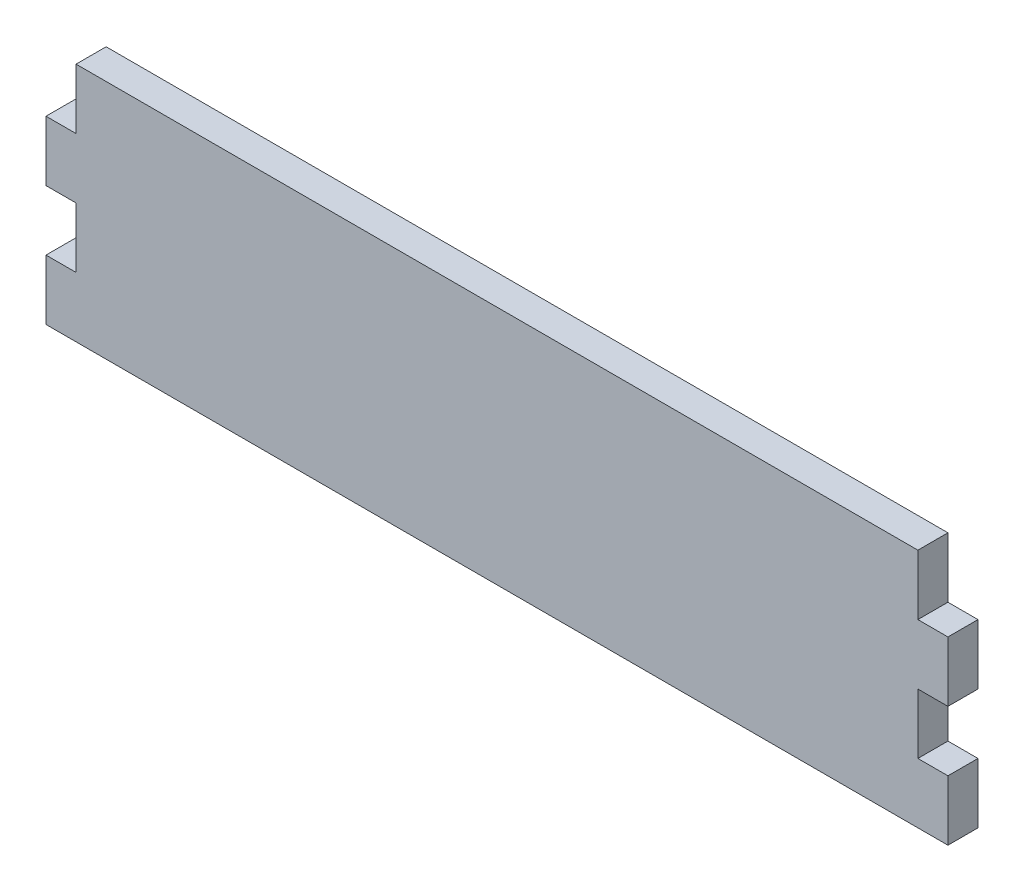
ISO-10303-21;
HEADER;
FILE_DESCRIPTION(('STEP AP214'),'2;1');
FILE_NAME('part.step','',(''),(''),'','','');
FILE_SCHEMA(('AUTOMOTIVE_DESIGN { 1 0 10303 214 1 1 1 1 }'));
ENDSEC;
DATA;
#1=APPLICATION_CONTEXT('core data for automotive mechanical design processes');
#2=APPLICATION_PROTOCOL_DEFINITION('international standard','automotive_design',2000,#1);
#3=PRODUCT_CONTEXT('',#1,'mechanical');
#4=PRODUCT('Part','Part','',(#3));
#5=PRODUCT_RELATED_PRODUCT_CATEGORY('part','',(#4));
#6=PRODUCT_DEFINITION_FORMATION('','',#4);
#7=PRODUCT_DEFINITION_CONTEXT('part definition',#1,'design');
#8=PRODUCT_DEFINITION('design','',#6,#7);
#9=PRODUCT_DEFINITION_SHAPE('','',#8);
#10=(LENGTH_UNIT() NAMED_UNIT(*) SI_UNIT(.MILLI.,.METRE.));
#11=(NAMED_UNIT(*) PLANE_ANGLE_UNIT() SI_UNIT($,.RADIAN.));
#12=(NAMED_UNIT(*) SI_UNIT($,.STERADIAN.) SOLID_ANGLE_UNIT());
#13=UNCERTAINTY_MEASURE_WITH_UNIT(LENGTH_MEASURE(1.E-05),#10,'distance_accuracy_value','');
#14=(GEOMETRIC_REPRESENTATION_CONTEXT(3) GLOBAL_UNCERTAINTY_ASSIGNED_CONTEXT((#13)) GLOBAL_UNIT_ASSIGNED_CONTEXT((#10,
#11,#12)) REPRESENTATION_CONTEXT('',''));
#15=CARTESIAN_POINT('',(0.,0.,0.));
#16=DIRECTION('',(0.,0.,1.));
#17=DIRECTION('',(1.,0.,0.));
#18=AXIS2_PLACEMENT_3D('',#15,#16,#17);
#19=CARTESIAN_POINT('',(-95.25,25.4,6.35));
#20=DIRECTION('',(1.,0.,0.));
#21=DIRECTION('',(0.,0.,-1.));
#22=AXIS2_PLACEMENT_3D('',#19,#20,#21);
#23=PLANE('',#22);
#24=DIRECTION('',(0.,0.,1.));
#25=VECTOR('',#24,1.);
#26=CARTESIAN_POINT('',(-95.25,12.7,0.));
#27=LINE('',#26,#25);
#28=CARTESIAN_POINT('',(-95.25,12.7,0.));
#29=VERTEX_POINT('',#28);
#30=CARTESIAN_POINT('',(-95.25,12.7,6.35));
#31=VERTEX_POINT('',#30);
#32=EDGE_CURVE('E150',#29,#31,#27,.T.);
#33=ORIENTED_EDGE('',*,*,#32,.F.);
#34=DIRECTION('',(0.,-1.,0.));
#35=VECTOR('',#34,1.);
#36=CARTESIAN_POINT('',(-95.25,25.4,0.));
#37=LINE('',#36,#35);
#38=CARTESIAN_POINT('',(-95.25,0.,0.));
#39=VERTEX_POINT('',#38);
#40=EDGE_CURVE('E161',#29,#39,#37,.T.);
#41=ORIENTED_EDGE('',*,*,#40,.T.);
#42=DIRECTION('',(0.,0.,1.));
#43=VECTOR('',#42,1.);
#44=CARTESIAN_POINT('',(-95.25,0.,0.));
#45=LINE('',#44,#43);
#46=CARTESIAN_POINT('',(-95.25,0.,6.35));
#47=VERTEX_POINT('',#46);
#48=EDGE_CURVE('E264',#39,#47,#45,.T.);
#49=ORIENTED_EDGE('',*,*,#48,.T.);
#50=DIRECTION('',(0.,-1.,0.));
#51=VECTOR('',#50,1.);
#52=CARTESIAN_POINT('',(-95.25,25.4,6.35));
#53=LINE('',#52,#51);
#54=EDGE_CURVE('E163',#31,#47,#53,.T.);
#55=ORIENTED_EDGE('',*,*,#54,.F.);
#56=EDGE_LOOP('',(#33,#41,#49,#55));
#57=FACE_BOUND('',#56,.T.);
#58=ADVANCED_FACE('F33',(#57),#23,.F.);
#59=CARTESIAN_POINT('',(0.,0.,6.35));
#60=DIRECTION('',(0.,0.,1.));
#61=DIRECTION('',(1.,0.,0.));
#62=AXIS2_PLACEMENT_3D('',#59,#60,#61);
#63=PLANE('',#62);
#64=DIRECTION('',(-1.,0.,0.));
#65=VECTOR('',#64,1.);
#66=CARTESIAN_POINT('',(-95.25,25.4,6.35));
#67=LINE('',#66,#65);
#68=CARTESIAN_POINT('',(88.9,25.4,6.35));
#69=VERTEX_POINT('',#68);
#70=CARTESIAN_POINT('',(-88.9,25.4,6.35));
#71=VERTEX_POINT('',#70);
#72=EDGE_CURVE('E214',#69,#71,#67,.T.);
#73=ORIENTED_EDGE('',*,*,#72,.T.);
#74=DIRECTION('',(0.,-1.,0.));
#75=VECTOR('',#74,1.);
#76=CARTESIAN_POINT('',(-88.9,12.7,6.35));
#77=LINE('',#76,#75);
#78=CARTESIAN_POINT('',(-88.9,12.7,6.35));
#79=VERTEX_POINT('',#78);
#80=EDGE_CURVE('E48',#71,#79,#77,.T.);
#81=ORIENTED_EDGE('',*,*,#80,.T.);
#82=DIRECTION('',(-1.,0.,0.));
#83=VECTOR('',#82,1.);
#84=CARTESIAN_POINT('',(-95.25,12.7,6.35));
#85=LINE('',#84,#83);
#86=EDGE_CURVE('E290',#79,#31,#85,.T.);
#87=ORIENTED_EDGE('',*,*,#86,.T.);
#88=ORIENTED_EDGE('',*,*,#54,.T.);
#89=DIRECTION('',(1.,0.,0.));
#90=VECTOR('',#89,1.);
#91=CARTESIAN_POINT('',(-95.25,0.,6.35));
#92=LINE('',#91,#90);
#93=CARTESIAN_POINT('',(-88.9,0.,6.35));
#94=VERTEX_POINT('',#93);
#95=EDGE_CURVE('E275',#47,#94,#92,.T.);
#96=ORIENTED_EDGE('',*,*,#95,.T.);
#97=DIRECTION('',(0.,-1.,0.));
#98=VECTOR('',#97,1.);
#99=CARTESIAN_POINT('',(-88.9,-12.7,6.35));
#100=LINE('',#99,#98);
#101=CARTESIAN_POINT('',(-88.9,-12.7,6.35));
#102=VERTEX_POINT('',#101);
#103=EDGE_CURVE('E279',#94,#102,#100,.T.);
#104=ORIENTED_EDGE('',*,*,#103,.T.);
#105=DIRECTION('',(-1.,0.,0.));
#106=VECTOR('',#105,1.);
#107=CARTESIAN_POINT('',(-95.25,-12.7,6.35));
#108=LINE('',#107,#106);
#109=CARTESIAN_POINT('',(-95.25,-12.7,6.35));
#110=VERTEX_POINT('',#109);
#111=EDGE_CURVE('E223',#102,#110,#108,.T.);
#112=ORIENTED_EDGE('',*,*,#111,.T.);
#113=CARTESIAN_POINT('',(-95.25,-25.4,6.35));
#114=VERTEX_POINT('',#113);
#115=EDGE_CURVE('E188',#110,#114,#53,.T.);
#116=ORIENTED_EDGE('',*,*,#115,.T.);
#117=DIRECTION('',(1.,0.,0.));
#118=VECTOR('',#117,1.);
#119=CARTESIAN_POINT('',(-95.25,-25.4,6.35));
#120=LINE('',#119,#118);
#121=CARTESIAN_POINT('',(95.25,-25.4,6.35));
#122=VERTEX_POINT('',#121);
#123=EDGE_CURVE('E178',#114,#122,#120,.T.);
#124=ORIENTED_EDGE('',*,*,#123,.T.);
#125=DIRECTION('',(0.,1.,0.));
#126=VECTOR('',#125,1.);
#127=CARTESIAN_POINT('',(95.25,25.4,6.35));
#128=LINE('',#127,#126);
#129=CARTESIAN_POINT('',(95.25,-12.7,6.35));
#130=VERTEX_POINT('',#129);
#131=EDGE_CURVE('E213',#122,#130,#128,.T.);
#132=ORIENTED_EDGE('',*,*,#131,.T.);
#133=DIRECTION('',(1.,0.,0.));
#134=VECTOR('',#133,1.);
#135=CARTESIAN_POINT('',(95.25,-12.7,6.35));
#136=LINE('',#135,#134);
#137=CARTESIAN_POINT('',(88.9,-12.7,6.35));
#138=VERTEX_POINT('',#137);
#139=EDGE_CURVE('E206',#138,#130,#136,.T.);
#140=ORIENTED_EDGE('',*,*,#139,.F.);
#141=DIRECTION('',(0.,-1.,0.));
#142=VECTOR('',#141,1.);
#143=CARTESIAN_POINT('',(88.9,-12.7,6.35));
#144=LINE('',#143,#142);
#145=CARTESIAN_POINT('',(88.9,0.,6.35));
#146=VERTEX_POINT('',#145);
#147=EDGE_CURVE('E236',#146,#138,#144,.T.);
#148=ORIENTED_EDGE('',*,*,#147,.F.);
#149=DIRECTION('',(-1.,0.,0.));
#150=VECTOR('',#149,1.);
#151=CARTESIAN_POINT('',(95.25,0.,6.35));
#152=LINE('',#151,#150);
#153=CARTESIAN_POINT('',(95.25,0.,6.35));
#154=VERTEX_POINT('',#153);
#155=EDGE_CURVE('E242',#154,#146,#152,.T.);
#156=ORIENTED_EDGE('',*,*,#155,.F.);
#157=CARTESIAN_POINT('',(95.25,12.7,6.35));
#158=VERTEX_POINT('',#157);
#159=EDGE_CURVE('E172',#154,#158,#128,.T.);
#160=ORIENTED_EDGE('',*,*,#159,.T.);
#161=DIRECTION('',(1.,0.,0.));
#162=VECTOR('',#161,1.);
#163=CARTESIAN_POINT('',(95.25,12.7,6.35));
#164=LINE('',#163,#162);
#165=CARTESIAN_POINT('',(88.9,12.7,6.35));
#166=VERTEX_POINT('',#165);
#167=EDGE_CURVE('E258',#166,#158,#164,.T.);
#168=ORIENTED_EDGE('',*,*,#167,.F.);
#169=DIRECTION('',(0.,-1.,0.));
#170=VECTOR('',#169,1.);
#171=CARTESIAN_POINT('',(88.9,12.7,6.35));
#172=LINE('',#171,#170);
#173=EDGE_CURVE('E261',#69,#166,#172,.T.);
#174=ORIENTED_EDGE('',*,*,#173,.F.);
#175=EDGE_LOOP('',(#73,#81,#87,#88,#96,#104,#112,#116,#124,#132,#140,#148,#156,#160,#168,#174));
#176=FACE_BOUND('',#175,.T.);
#177=ADVANCED_FACE('F221',(#176),#63,.T.);
#178=CARTESIAN_POINT('',(0.,0.,0.));
#179=DIRECTION('',(0.,0.,1.));
#180=DIRECTION('',(1.,0.,0.));
#181=AXIS2_PLACEMENT_3D('',#178,#179,#180);
#182=PLANE('',#181);
#183=DIRECTION('',(0.,-1.,0.));
#184=VECTOR('',#183,1.);
#185=CARTESIAN_POINT('',(-88.9,12.7,0.));
#186=LINE('',#185,#184);
#187=CARTESIAN_POINT('',(-88.9,25.4,0.));
#188=VERTEX_POINT('',#187);
#189=CARTESIAN_POINT('',(-88.9,12.7,0.));
#190=VERTEX_POINT('',#189);
#191=EDGE_CURVE('E156',#188,#190,#186,.T.);
#192=ORIENTED_EDGE('',*,*,#191,.F.);
#193=DIRECTION('',(-1.,0.,0.));
#194=VECTOR('',#193,1.);
#195=CARTESIAN_POINT('',(-95.25,25.4,0.));
#196=LINE('',#195,#194);
#197=CARTESIAN_POINT('',(88.9,25.4,0.));
#198=VERTEX_POINT('',#197);
#199=EDGE_CURVE('E174',#198,#188,#196,.T.);
#200=ORIENTED_EDGE('',*,*,#199,.F.);
#201=DIRECTION('',(0.,-1.,0.));
#202=VECTOR('',#201,1.);
#203=CARTESIAN_POINT('',(88.9,12.7,0.));
#204=LINE('',#203,#202);
#205=CARTESIAN_POINT('',(88.9,12.7,0.));
#206=VERTEX_POINT('',#205);
#207=EDGE_CURVE('E260',#198,#206,#204,.T.);
#208=ORIENTED_EDGE('',*,*,#207,.T.);
#209=DIRECTION('',(1.,0.,0.));
#210=VECTOR('',#209,1.);
#211=CARTESIAN_POINT('',(95.25,12.7,0.));
#212=LINE('',#211,#210);
#213=CARTESIAN_POINT('',(95.25,12.7,0.));
#214=VERTEX_POINT('',#213);
#215=EDGE_CURVE('E255',#206,#214,#212,.T.);
#216=ORIENTED_EDGE('',*,*,#215,.T.);
#217=DIRECTION('',(0.,1.,0.));
#218=VECTOR('',#217,1.);
#219=CARTESIAN_POINT('',(95.25,25.4,0.));
#220=LINE('',#219,#218);
#221=CARTESIAN_POINT('',(95.25,0.,0.));
#222=VERTEX_POINT('',#221);
#223=EDGE_CURVE('E192',#222,#214,#220,.T.);
#224=ORIENTED_EDGE('',*,*,#223,.F.);
#225=DIRECTION('',(-1.,0.,0.));
#226=VECTOR('',#225,1.);
#227=CARTESIAN_POINT('',(95.25,0.,0.));
#228=LINE('',#227,#226);
#229=CARTESIAN_POINT('',(88.9,0.,0.));
#230=VERTEX_POINT('',#229);
#231=EDGE_CURVE('E238',#222,#230,#228,.T.);
#232=ORIENTED_EDGE('',*,*,#231,.T.);
#233=DIRECTION('',(0.,-1.,0.));
#234=VECTOR('',#233,1.);
#235=CARTESIAN_POINT('',(88.9,-12.7,0.));
#236=LINE('',#235,#234);
#237=CARTESIAN_POINT('',(88.9,-12.7,0.));
#238=VERTEX_POINT('',#237);
#239=EDGE_CURVE('E240',#230,#238,#236,.T.);
#240=ORIENTED_EDGE('',*,*,#239,.T.);
#241=DIRECTION('',(1.,0.,0.));
#242=VECTOR('',#241,1.);
#243=CARTESIAN_POINT('',(95.25,-12.7,0.));
#244=LINE('',#243,#242);
#245=CARTESIAN_POINT('',(95.25,-12.7,0.));
#246=VERTEX_POINT('',#245);
#247=EDGE_CURVE('E212',#238,#246,#244,.T.);
#248=ORIENTED_EDGE('',*,*,#247,.T.);
#249=CARTESIAN_POINT('',(95.25,-25.4,0.));
#250=VERTEX_POINT('',#249);
#251=EDGE_CURVE('E191',#250,#246,#220,.T.);
#252=ORIENTED_EDGE('',*,*,#251,.F.);
#253=DIRECTION('',(1.,0.,0.));
#254=VECTOR('',#253,1.);
#255=CARTESIAN_POINT('',(-95.25,-25.4,0.));
#256=LINE('',#255,#254);
#257=CARTESIAN_POINT('',(-95.25,-25.4,0.));
#258=VERTEX_POINT('',#257);
#259=EDGE_CURVE('E169',#258,#250,#256,.T.);
#260=ORIENTED_EDGE('',*,*,#259,.F.);
#261=CARTESIAN_POINT('',(-95.25,-12.7,0.));
#262=VERTEX_POINT('',#261);
#263=EDGE_CURVE('E170',#262,#258,#37,.T.);
#264=ORIENTED_EDGE('',*,*,#263,.F.);
#265=DIRECTION('',(-1.,0.,0.));
#266=VECTOR('',#265,1.);
#267=CARTESIAN_POINT('',(-95.25,-12.7,0.));
#268=LINE('',#267,#266);
#269=CARTESIAN_POINT('',(-88.9,-12.7,0.));
#270=VERTEX_POINT('',#269);
#271=EDGE_CURVE('E278',#270,#262,#268,.T.);
#272=ORIENTED_EDGE('',*,*,#271,.F.);
#273=DIRECTION('',(0.,-1.,0.));
#274=VECTOR('',#273,1.);
#275=CARTESIAN_POINT('',(-88.9,-12.7,0.));
#276=LINE('',#275,#274);
#277=CARTESIAN_POINT('',(-88.9,0.,0.));
#278=VERTEX_POINT('',#277);
#279=EDGE_CURVE('E284',#278,#270,#276,.T.);
#280=ORIENTED_EDGE('',*,*,#279,.F.);
#281=DIRECTION('',(1.,0.,0.));
#282=VECTOR('',#281,1.);
#283=CARTESIAN_POINT('',(-95.25,0.,0.));
#284=LINE('',#283,#282);
#285=EDGE_CURVE('E168',#39,#278,#284,.T.);
#286=ORIENTED_EDGE('',*,*,#285,.F.);
#287=ORIENTED_EDGE('',*,*,#40,.F.);
#288=DIRECTION('',(-1.,0.,0.));
#289=VECTOR('',#288,1.);
#290=CARTESIAN_POINT('',(-95.25,12.7,0.));
#291=LINE('',#290,#289);
#292=EDGE_CURVE('E146',#190,#29,#291,.T.);
#293=ORIENTED_EDGE('',*,*,#292,.F.);
#294=EDGE_LOOP('',(#192,#200,#208,#216,#224,#232,#240,#248,#252,#260,#264,#272,#280,#286,#287,#293));
#295=FACE_BOUND('',#294,.T.);
#296=ADVANCED_FACE('F166',(#295),#182,.F.);
#297=CARTESIAN_POINT('',(-95.25,25.4,6.35));
#298=DIRECTION('',(0.,-1.,0.));
#299=DIRECTION('',(0.,0.,-1.));
#300=AXIS2_PLACEMENT_3D('',#297,#298,#299);
#301=PLANE('',#300);
#302=DIRECTION('',(0.,0.,1.));
#303=VECTOR('',#302,1.);
#304=CARTESIAN_POINT('',(-88.9,25.4,0.));
#305=LINE('',#304,#303);
#306=EDGE_CURVE('E282',#188,#71,#305,.T.);
#307=ORIENTED_EDGE('',*,*,#306,.T.);
#308=ORIENTED_EDGE('',*,*,#72,.F.);
#309=DIRECTION('',(0.,0.,1.));
#310=VECTOR('',#309,1.);
#311=CARTESIAN_POINT('',(88.9,25.4,0.));
#312=LINE('',#311,#310);
#313=EDGE_CURVE('E252',#198,#69,#312,.T.);
#314=ORIENTED_EDGE('',*,*,#313,.F.);
#315=ORIENTED_EDGE('',*,*,#199,.T.);
#316=EDGE_LOOP('',(#307,#308,#314,#315));
#317=FACE_BOUND('',#316,.T.);
#318=ADVANCED_FACE('F296',(#317),#301,.F.);
#319=DIRECTION('',(0.,0.,1.));
#320=VECTOR('',#319,1.);
#321=CARTESIAN_POINT('',(-95.25,-12.7,0.));
#322=LINE('',#321,#320);
#323=EDGE_CURVE('E269',#262,#110,#322,.T.);
#324=ORIENTED_EDGE('',*,*,#323,.F.);
#325=ORIENTED_EDGE('',*,*,#263,.T.);
#326=DIRECTION('',(0.,0.,-1.));
#327=VECTOR('',#326,1.);
#328=CARTESIAN_POINT('',(-95.25,-25.4,6.35));
#329=LINE('',#328,#327);
#330=EDGE_CURVE('E11',#114,#258,#329,.T.);
#331=ORIENTED_EDGE('',*,*,#330,.F.);
#332=ORIENTED_EDGE('',*,*,#115,.F.);
#333=EDGE_LOOP('',(#324,#325,#331,#332));
#334=FACE_BOUND('',#333,.T.);
#335=ADVANCED_FACE('F226',(#334),#23,.F.);
#336=CARTESIAN_POINT('',(95.25,25.4,6.35));
#337=DIRECTION('',(-1.,0.,0.));
#338=DIRECTION('',(0.,0.,1.));
#339=AXIS2_PLACEMENT_3D('',#336,#337,#338);
#340=PLANE('',#339);
#341=ORIENTED_EDGE('',*,*,#251,.T.);
#342=DIRECTION('',(0.,0.,1.));
#343=VECTOR('',#342,1.);
#344=CARTESIAN_POINT('',(95.25,-12.7,0.));
#345=LINE('',#344,#343);
#346=EDGE_CURVE('E196',#246,#130,#345,.T.);
#347=ORIENTED_EDGE('',*,*,#346,.T.);
#348=ORIENTED_EDGE('',*,*,#131,.F.);
#349=DIRECTION('',(0.,0.,-1.));
#350=VECTOR('',#349,1.);
#351=CARTESIAN_POINT('',(95.25,-25.4,6.35));
#352=LINE('',#351,#350);
#353=EDGE_CURVE('E41',#122,#250,#352,.T.);
#354=ORIENTED_EDGE('',*,*,#353,.T.);
#355=EDGE_LOOP('',(#341,#347,#348,#354));
#356=FACE_BOUND('',#355,.T.);
#357=ADVANCED_FACE('F231',(#356),#340,.F.);
#358=ORIENTED_EDGE('',*,*,#223,.T.);
#359=DIRECTION('',(0.,0.,1.));
#360=VECTOR('',#359,1.);
#361=CARTESIAN_POINT('',(95.25,12.7,0.));
#362=LINE('',#361,#360);
#363=EDGE_CURVE('E245',#214,#158,#362,.T.);
#364=ORIENTED_EDGE('',*,*,#363,.T.);
#365=ORIENTED_EDGE('',*,*,#159,.F.);
#366=DIRECTION('',(0.,0.,1.));
#367=VECTOR('',#366,1.);
#368=CARTESIAN_POINT('',(95.25,0.,0.));
#369=LINE('',#368,#367);
#370=EDGE_CURVE('E210',#222,#154,#369,.T.);
#371=ORIENTED_EDGE('',*,*,#370,.F.);
#372=EDGE_LOOP('',(#358,#364,#365,#371));
#373=FACE_BOUND('',#372,.T.);
#374=ADVANCED_FACE('F35',(#373),#340,.F.);
#375=CARTESIAN_POINT('',(-95.25,-25.4,6.35));
#376=DIRECTION('',(0.,1.,0.));
#377=DIRECTION('',(0.,0.,1.));
#378=AXIS2_PLACEMENT_3D('',#375,#376,#377);
#379=PLANE('',#378);
#380=ORIENTED_EDGE('',*,*,#259,.T.);
#381=ORIENTED_EDGE('',*,*,#353,.F.);
#382=ORIENTED_EDGE('',*,*,#123,.F.);
#383=ORIENTED_EDGE('',*,*,#330,.T.);
#384=EDGE_LOOP('',(#380,#381,#382,#383));
#385=FACE_BOUND('',#384,.T.);
#386=ADVANCED_FACE('F230',(#385),#379,.F.);
#387=CARTESIAN_POINT('',(95.25,-12.7,0.));
#388=DIRECTION('',(0.,-1.,0.));
#389=DIRECTION('',(1.,0.,0.));
#390=AXIS2_PLACEMENT_3D('',#387,#388,#389);
#391=PLANE('',#390);
#392=ORIENTED_EDGE('',*,*,#139,.T.);
#393=ORIENTED_EDGE('',*,*,#346,.F.);
#394=ORIENTED_EDGE('',*,*,#247,.F.);
#395=DIRECTION('',(0.,0.,1.));
#396=VECTOR('',#395,1.);
#397=CARTESIAN_POINT('',(88.9,-12.7,0.));
#398=LINE('',#397,#396);
#399=EDGE_CURVE('E201',#238,#138,#398,.T.);
#400=ORIENTED_EDGE('',*,*,#399,.T.);
#401=EDGE_LOOP('',(#392,#393,#394,#400));
#402=FACE_BOUND('',#401,.T.);
#403=ADVANCED_FACE('F310',(#402),#391,.F.);
#404=CARTESIAN_POINT('',(88.9,-12.7,0.));
#405=DIRECTION('',(-1.,0.,0.));
#406=DIRECTION('',(0.,0.,1.));
#407=AXIS2_PLACEMENT_3D('',#404,#405,#406);
#408=PLANE('',#407);
#409=ORIENTED_EDGE('',*,*,#147,.T.);
#410=ORIENTED_EDGE('',*,*,#399,.F.);
#411=ORIENTED_EDGE('',*,*,#239,.F.);
#412=DIRECTION('',(0.,0.,1.));
#413=VECTOR('',#412,1.);
#414=CARTESIAN_POINT('',(88.9,0.,0.));
#415=LINE('',#414,#413);
#416=EDGE_CURVE('E203',#230,#146,#415,.T.);
#417=ORIENTED_EDGE('',*,*,#416,.T.);
#418=EDGE_LOOP('',(#409,#410,#411,#417));
#419=FACE_BOUND('',#418,.T.);
#420=ADVANCED_FACE('F308',(#419),#408,.F.);
#421=CARTESIAN_POINT('',(95.25,0.,0.));
#422=DIRECTION('',(0.,1.,0.));
#423=DIRECTION('',(-1.,0.,0.));
#424=AXIS2_PLACEMENT_3D('',#421,#422,#423);
#425=PLANE('',#424);
#426=ORIENTED_EDGE('',*,*,#155,.T.);
#427=ORIENTED_EDGE('',*,*,#416,.F.);
#428=ORIENTED_EDGE('',*,*,#231,.F.);
#429=ORIENTED_EDGE('',*,*,#370,.T.);
#430=EDGE_LOOP('',(#426,#427,#428,#429));
#431=FACE_BOUND('',#430,.T.);
#432=ADVANCED_FACE('F307',(#431),#425,.F.);
#433=CARTESIAN_POINT('',(95.25,12.7,0.));
#434=DIRECTION('',(0.,-1.,0.));
#435=DIRECTION('',(1.,0.,0.));
#436=AXIS2_PLACEMENT_3D('',#433,#434,#435);
#437=PLANE('',#436);
#438=ORIENTED_EDGE('',*,*,#167,.T.);
#439=ORIENTED_EDGE('',*,*,#363,.F.);
#440=ORIENTED_EDGE('',*,*,#215,.F.);
#441=DIRECTION('',(0.,0.,1.));
#442=VECTOR('',#441,1.);
#443=CARTESIAN_POINT('',(88.9,12.7,0.));
#444=LINE('',#443,#442);
#445=EDGE_CURVE('E254',#206,#166,#444,.T.);
#446=ORIENTED_EDGE('',*,*,#445,.T.);
#447=EDGE_LOOP('',(#438,#439,#440,#446));
#448=FACE_BOUND('',#447,.T.);
#449=ADVANCED_FACE('F304',(#448),#437,.F.);
#450=CARTESIAN_POINT('',(88.9,12.7,0.));
#451=DIRECTION('',(-1.,0.,0.));
#452=DIRECTION('',(0.,0.,1.));
#453=AXIS2_PLACEMENT_3D('',#450,#451,#452);
#454=PLANE('',#453);
#455=ORIENTED_EDGE('',*,*,#173,.T.);
#456=ORIENTED_EDGE('',*,*,#445,.F.);
#457=ORIENTED_EDGE('',*,*,#207,.F.);
#458=ORIENTED_EDGE('',*,*,#313,.T.);
#459=EDGE_LOOP('',(#455,#456,#457,#458));
#460=FACE_BOUND('',#459,.T.);
#461=ADVANCED_FACE('F298',(#460),#454,.F.);
#462=CARTESIAN_POINT('',(-95.25,0.,0.));
#463=DIRECTION('',(0.,-1.,0.));
#464=DIRECTION('',(1.,0.,0.));
#465=AXIS2_PLACEMENT_3D('',#462,#463,#464);
#466=PLANE('',#465);
#467=ORIENTED_EDGE('',*,*,#95,.F.);
#468=ORIENTED_EDGE('',*,*,#48,.F.);
#469=ORIENTED_EDGE('',*,*,#285,.T.);
#470=DIRECTION('',(0.,0.,1.));
#471=VECTOR('',#470,1.);
#472=CARTESIAN_POINT('',(-88.9,0.,0.));
#473=LINE('',#472,#471);
#474=EDGE_CURVE('E272',#278,#94,#473,.T.);
#475=ORIENTED_EDGE('',*,*,#474,.T.);
#476=EDGE_LOOP('',(#467,#468,#469,#475));
#477=FACE_BOUND('',#476,.T.);
#478=ADVANCED_FACE('F319',(#477),#466,.T.);
#479=CARTESIAN_POINT('',(-88.9,-12.7,0.));
#480=DIRECTION('',(-1.,0.,0.));
#481=DIRECTION('',(0.,0.,1.));
#482=AXIS2_PLACEMENT_3D('',#479,#480,#481);
#483=PLANE('',#482);
#484=ORIENTED_EDGE('',*,*,#103,.F.);
#485=ORIENTED_EDGE('',*,*,#474,.F.);
#486=ORIENTED_EDGE('',*,*,#279,.T.);
#487=DIRECTION('',(0.,0.,1.));
#488=VECTOR('',#487,1.);
#489=CARTESIAN_POINT('',(-88.9,-12.7,0.));
#490=LINE('',#489,#488);
#491=EDGE_CURVE('E56',#270,#102,#490,.T.);
#492=ORIENTED_EDGE('',*,*,#491,.T.);
#493=EDGE_LOOP('',(#484,#485,#486,#492));
#494=FACE_BOUND('',#493,.T.);
#495=ADVANCED_FACE('F317',(#494),#483,.T.);
#496=CARTESIAN_POINT('',(-95.25,-12.7,0.));
#497=DIRECTION('',(0.,1.,0.));
#498=DIRECTION('',(-1.,0.,0.));
#499=AXIS2_PLACEMENT_3D('',#496,#497,#498);
#500=PLANE('',#499);
#501=ORIENTED_EDGE('',*,*,#111,.F.);
#502=ORIENTED_EDGE('',*,*,#491,.F.);
#503=ORIENTED_EDGE('',*,*,#271,.T.);
#504=ORIENTED_EDGE('',*,*,#323,.T.);
#505=EDGE_LOOP('',(#501,#502,#503,#504));
#506=FACE_BOUND('',#505,.T.);
#507=ADVANCED_FACE('F312',(#506),#500,.T.);
#508=CARTESIAN_POINT('',(-88.9,12.7,0.));
#509=DIRECTION('',(-1.,0.,0.));
#510=DIRECTION('',(0.,0.,1.));
#511=AXIS2_PLACEMENT_3D('',#508,#509,#510);
#512=PLANE('',#511);
#513=ORIENTED_EDGE('',*,*,#80,.F.);
#514=ORIENTED_EDGE('',*,*,#306,.F.);
#515=ORIENTED_EDGE('',*,*,#191,.T.);
#516=DIRECTION('',(0.,0.,1.));
#517=VECTOR('',#516,1.);
#518=CARTESIAN_POINT('',(-88.9,12.7,0.));
#519=LINE('',#518,#517);
#520=EDGE_CURVE('E152',#190,#79,#519,.T.);
#521=ORIENTED_EDGE('',*,*,#520,.T.);
#522=EDGE_LOOP('',(#513,#514,#515,#521));
#523=FACE_BOUND('',#522,.T.);
#524=ADVANCED_FACE('F292',(#523),#512,.T.);
#525=CARTESIAN_POINT('',(-95.25,12.7,0.));
#526=DIRECTION('',(0.,1.,0.));
#527=DIRECTION('',(-1.,0.,0.));
#528=AXIS2_PLACEMENT_3D('',#525,#526,#527);
#529=PLANE('',#528);
#530=ORIENTED_EDGE('',*,*,#86,.F.);
#531=ORIENTED_EDGE('',*,*,#520,.F.);
#532=ORIENTED_EDGE('',*,*,#292,.T.);
#533=ORIENTED_EDGE('',*,*,#32,.T.);
#534=EDGE_LOOP('',(#530,#531,#532,#533));
#535=FACE_BOUND('',#534,.T.);
#536=ADVANCED_FACE('F149',(#535),#529,.T.);
#537=CLOSED_SHELL('',(#58,#177,#296,#318,#335,#357,#374,#386,#403,#420,#432,#449,#461,#478,#495,
#507,#524,#536));
#538=MANIFOLD_SOLID_BREP('B2',#537);
#539=ADVANCED_BREP_SHAPE_REPRESENTATION('',(#18,#538),#14);
#540=SHAPE_DEFINITION_REPRESENTATION(#9,#539);
ENDSEC;
END-ISO-10303-21;
